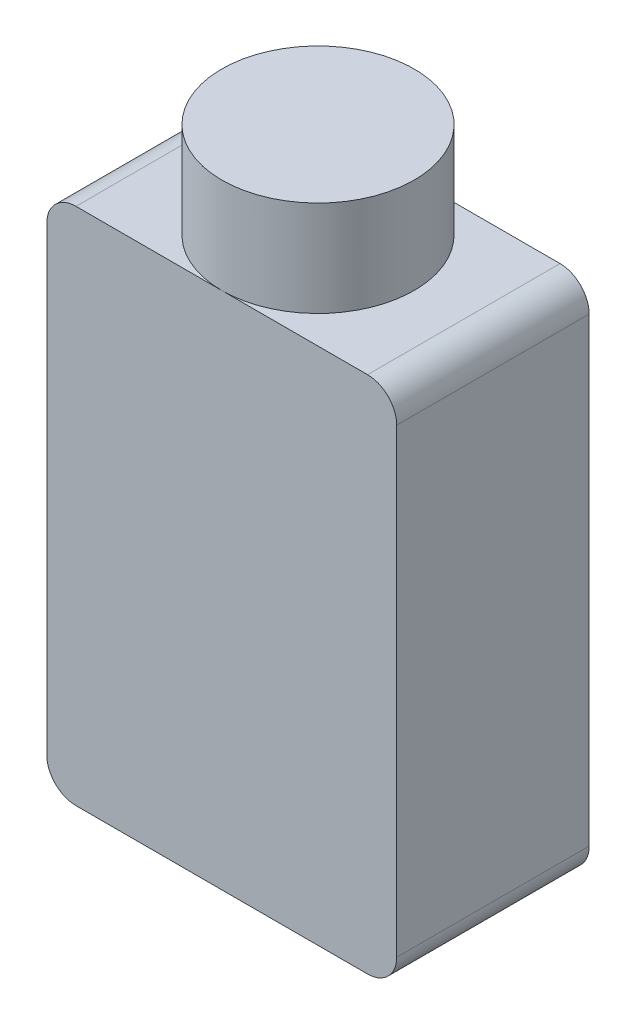
ISO-10303-21;
HEADER;
FILE_DESCRIPTION(('STEP AP214'),'2;1');
FILE_NAME('part.step','',(''),(''),'','','');
FILE_SCHEMA(('AUTOMOTIVE_DESIGN { 1 0 10303 214 1 1 1 1 }'));
ENDSEC;
DATA;
#1=APPLICATION_CONTEXT('core data for automotive mechanical design processes');
#2=APPLICATION_PROTOCOL_DEFINITION('international standard','automotive_design',2000,#1);
#3=PRODUCT_CONTEXT('',#1,'mechanical');
#4=PRODUCT('Part','Part','',(#3));
#5=PRODUCT_RELATED_PRODUCT_CATEGORY('part','',(#4));
#6=PRODUCT_DEFINITION_FORMATION('','',#4);
#7=PRODUCT_DEFINITION_CONTEXT('part definition',#1,'design');
#8=PRODUCT_DEFINITION('design','',#6,#7);
#9=PRODUCT_DEFINITION_SHAPE('','',#8);
#10=(LENGTH_UNIT() NAMED_UNIT(*) SI_UNIT(.MILLI.,.METRE.));
#11=(NAMED_UNIT(*) PLANE_ANGLE_UNIT() SI_UNIT($,.RADIAN.));
#12=(NAMED_UNIT(*) SI_UNIT($,.STERADIAN.) SOLID_ANGLE_UNIT());
#13=UNCERTAINTY_MEASURE_WITH_UNIT(LENGTH_MEASURE(1.E-05),#10,'distance_accuracy_value','');
#14=(GEOMETRIC_REPRESENTATION_CONTEXT(3) GLOBAL_UNCERTAINTY_ASSIGNED_CONTEXT((#13)) GLOBAL_UNIT_ASSIGNED_CONTEXT((#10,
#11,#12)) REPRESENTATION_CONTEXT('',''));
#15=CARTESIAN_POINT('',(0.,0.,0.));
#16=DIRECTION('',(0.,0.,1.));
#17=DIRECTION('',(1.,0.,0.));
#18=AXIS2_PLACEMENT_3D('',#15,#16,#17);
#19=CARTESIAN_POINT('',(0.,56.515,0.));
#20=DIRECTION('',(0.,-1.,0.));
#21=DIRECTION('',(0.,0.,-1.));
#22=AXIS2_PLACEMENT_3D('',#19,#20,#21);
#23=PLANE('',#22);
#24=CARTESIAN_POINT('',(0.,56.515,0.));
#25=DIRECTION('',(0.,-1.,0.));
#26=DIRECTION('',(0.,0.,-1.));
#27=AXIS2_PLACEMENT_3D('',#24,#25,#26);
#28=CIRCLE('',#27,10.4775);
#29=CARTESIAN_POINT('',(0.,56.515,-10.4775));
#30=VERTEX_POINT('',#29);
#31=CARTESIAN_POINT('',(0.,56.515,10.4775));
#32=VERTEX_POINT('',#31);
#33=EDGE_CURVE('E11',#30,#32,#28,.F.);
#34=ORIENTED_EDGE('',*,*,#33,.F.);
#35=DIRECTION('',(-1.,0.,0.));
#36=VECTOR('',#35,1.);
#37=CARTESIAN_POINT('',(-19.05,56.515,-10.4775));
#38=LINE('',#37,#36);
#39=CARTESIAN_POINT('',(-15.875,56.515,-10.4775));
#40=VERTEX_POINT('',#39);
#41=EDGE_CURVE('E123',#30,#40,#38,.T.);
#42=ORIENTED_EDGE('',*,*,#41,.T.);
#43=DIRECTION('',(0.,0.,1.));
#44=VECTOR('',#43,1.);
#45=CARTESIAN_POINT('',(-15.875,56.515,0.));
#46=LINE('',#45,#44);
#47=CARTESIAN_POINT('',(-15.875,56.515,10.4775));
#48=VERTEX_POINT('',#47);
#49=EDGE_CURVE('E175',#40,#48,#46,.T.);
#50=ORIENTED_EDGE('',*,*,#49,.T.);
#51=DIRECTION('',(1.,0.,0.));
#52=VECTOR('',#51,1.);
#53=CARTESIAN_POINT('',(-19.05,56.515,10.4775));
#54=LINE('',#53,#52);
#55=EDGE_CURVE('E138',#48,#32,#54,.T.);
#56=ORIENTED_EDGE('',*,*,#55,.T.);
#57=EDGE_LOOP('',(#34,#42,#50,#56));
#58=FACE_BOUND('',#57,.T.);
#59=ADVANCED_FACE('F43',(#58),#23,.F.);
#60=CARTESIAN_POINT('',(19.05,56.515,10.4775));
#61=DIRECTION('',(-1.,0.,0.));
#62=DIRECTION('',(0.,0.,1.));
#63=AXIS2_PLACEMENT_3D('',#60,#61,#62);
#64=PLANE('',#63);
#65=DIRECTION('',(0.,-1.,0.));
#66=VECTOR('',#65,1.);
#67=CARTESIAN_POINT('',(19.05,56.515,10.4775));
#68=LINE('',#67,#66);
#69=CARTESIAN_POINT('',(19.05,53.34,10.4775));
#70=VERTEX_POINT('',#69);
#71=CARTESIAN_POINT('',(19.05,3.17500000000001,10.4775));
#72=VERTEX_POINT('',#71);
#73=EDGE_CURVE('E151',#70,#72,#68,.T.);
#74=ORIENTED_EDGE('',*,*,#73,.T.);
#75=DIRECTION('',(0.,0.,-1.));
#76=VECTOR('',#75,1.);
#77=CARTESIAN_POINT('',(19.05,3.175,-10.4775));
#78=LINE('',#77,#76);
#79=CARTESIAN_POINT('',(19.05,3.17500000000001,-10.4775));
#80=VERTEX_POINT('',#79);
#81=EDGE_CURVE('E52',#72,#80,#78,.T.);
#82=ORIENTED_EDGE('',*,*,#81,.T.);
#83=DIRECTION('',(0.,-1.,0.));
#84=VECTOR('',#83,1.);
#85=CARTESIAN_POINT('',(19.05,56.515,-10.4775));
#86=LINE('',#85,#84);
#87=CARTESIAN_POINT('',(19.05,53.34,-10.4775));
#88=VERTEX_POINT('',#87);
#89=EDGE_CURVE('E169',#88,#80,#86,.T.);
#90=ORIENTED_EDGE('',*,*,#89,.F.);
#91=DIRECTION('',(0.,0.,-1.));
#92=VECTOR('',#91,1.);
#93=CARTESIAN_POINT('',(19.05,53.34,10.4775));
#94=LINE('',#93,#92);
#95=EDGE_CURVE('E214',#88,#70,#94,.F.);
#96=ORIENTED_EDGE('',*,*,#95,.T.);
#97=EDGE_LOOP('',(#74,#82,#90,#96));
#98=FACE_BOUND('',#97,.T.);
#99=ADVANCED_FACE('F219',(#98),#64,.F.);
#100=CARTESIAN_POINT('',(-19.05,56.515,-10.4775));
#101=DIRECTION('',(0.,0.,1.));
#102=DIRECTION('',(1.,0.,0.));
#103=AXIS2_PLACEMENT_3D('',#100,#101,#102);
#104=PLANE('',#103);
#105=DIRECTION('',(0.,-1.,0.));
#106=VECTOR('',#105,1.);
#107=CARTESIAN_POINT('',(-19.05,56.515,-10.4775));
#108=LINE('',#107,#106);
#109=CARTESIAN_POINT('',(-19.05,53.34,-10.4775));
#110=VERTEX_POINT('',#109);
#111=CARTESIAN_POINT('',(-19.05,3.17500000000001,-10.4775));
#112=VERTEX_POINT('',#111);
#113=EDGE_CURVE('E165',#110,#112,#108,.T.);
#114=ORIENTED_EDGE('',*,*,#113,.F.);
#115=CARTESIAN_POINT('',(-15.875,53.34,-10.4775));
#116=DIRECTION('',(0.,0.,1.));
#117=DIRECTION('',(1.,0.,0.));
#118=AXIS2_PLACEMENT_3D('',#115,#116,#117);
#119=CIRCLE('',#118,3.175);
#120=EDGE_CURVE('E130',#110,#40,#119,.F.);
#121=ORIENTED_EDGE('',*,*,#120,.T.);
#122=ORIENTED_EDGE('',*,*,#41,.F.);
#123=CARTESIAN_POINT('',(15.875,56.515,-10.4775));
#124=VERTEX_POINT('',#123);
#125=EDGE_CURVE('E115',#124,#30,#38,.T.);
#126=ORIENTED_EDGE('',*,*,#125,.F.);
#127=CARTESIAN_POINT('',(15.875,53.34,-10.4775));
#128=DIRECTION('',(0.,0.,1.));
#129=DIRECTION('',(1.,0.,0.));
#130=AXIS2_PLACEMENT_3D('',#127,#128,#129);
#131=CIRCLE('',#130,3.175);
#132=EDGE_CURVE('E198',#124,#88,#131,.F.);
#133=ORIENTED_EDGE('',*,*,#132,.T.);
#134=ORIENTED_EDGE('',*,*,#89,.T.);
#135=CARTESIAN_POINT('',(15.875,3.175,-10.4775));
#136=DIRECTION('',(0.,0.,1.));
#137=DIRECTION('',(1.,0.,0.));
#138=AXIS2_PLACEMENT_3D('',#135,#136,#137);
#139=CIRCLE('',#138,3.175);
#140=CARTESIAN_POINT('',(15.875,0.,-10.4775));
#141=VERTEX_POINT('',#140);
#142=EDGE_CURVE('E67',#80,#141,#139,.F.);
#143=ORIENTED_EDGE('',*,*,#142,.T.);
#144=DIRECTION('',(-1.,0.,0.));
#145=VECTOR('',#144,1.);
#146=CARTESIAN_POINT('',(-19.05,0.,-10.4775));
#147=LINE('',#146,#145);
#148=CARTESIAN_POINT('',(-15.875,0.,-10.4775));
#149=VERTEX_POINT('',#148);
#150=EDGE_CURVE('E146',#141,#149,#147,.T.);
#151=ORIENTED_EDGE('',*,*,#150,.T.);
#152=CARTESIAN_POINT('',(-15.875,3.175,-10.4775));
#153=DIRECTION('',(0.,0.,1.));
#154=DIRECTION('',(1.,0.,0.));
#155=AXIS2_PLACEMENT_3D('',#152,#153,#154);
#156=CIRCLE('',#155,3.175);
#157=EDGE_CURVE('E203',#149,#112,#156,.F.);
#158=ORIENTED_EDGE('',*,*,#157,.T.);
#159=EDGE_LOOP('',(#114,#121,#122,#126,#133,#134,#143,#151,#158));
#160=FACE_BOUND('',#159,.T.);
#161=ADVANCED_FACE('F128',(#160),#104,.F.);
#162=CARTESIAN_POINT('',(-19.05,56.515,10.4775));
#163=DIRECTION('',(1.,0.,0.));
#164=DIRECTION('',(0.,0.,-1.));
#165=AXIS2_PLACEMENT_3D('',#162,#163,#164);
#166=PLANE('',#165);
#167=DIRECTION('',(0.,-1.,0.));
#168=VECTOR('',#167,1.);
#169=CARTESIAN_POINT('',(-19.05,56.515,10.4775));
#170=LINE('',#169,#168);
#171=CARTESIAN_POINT('',(-19.05,53.34,10.4775));
#172=VERTEX_POINT('',#171);
#173=CARTESIAN_POINT('',(-19.05,3.17500000000001,10.4775));
#174=VERTEX_POINT('',#173);
#175=EDGE_CURVE('E161',#172,#174,#170,.T.);
#176=ORIENTED_EDGE('',*,*,#175,.F.);
#177=DIRECTION('',(0.,0.,1.));
#178=VECTOR('',#177,1.);
#179=CARTESIAN_POINT('',(-19.05,53.34,10.4775));
#180=LINE('',#179,#178);
#181=EDGE_CURVE('E195',#172,#110,#180,.F.);
#182=ORIENTED_EDGE('',*,*,#181,.T.);
#183=ORIENTED_EDGE('',*,*,#113,.T.);
#184=DIRECTION('',(0.,0.,1.));
#185=VECTOR('',#184,1.);
#186=CARTESIAN_POINT('',(-19.05,3.175,10.4775));
#187=LINE('',#186,#185);
#188=EDGE_CURVE('E191',#112,#174,#187,.T.);
#189=ORIENTED_EDGE('',*,*,#188,.T.);
#190=EDGE_LOOP('',(#176,#182,#183,#189));
#191=FACE_BOUND('',#190,.T.);
#192=ADVANCED_FACE('F239',(#191),#166,.F.);
#193=CARTESIAN_POINT('',(-19.05,56.515,10.4775));
#194=DIRECTION('',(0.,0.,-1.));
#195=DIRECTION('',(-1.,0.,0.));
#196=AXIS2_PLACEMENT_3D('',#193,#194,#195);
#197=PLANE('',#196);
#198=ORIENTED_EDGE('',*,*,#55,.F.);
#199=CARTESIAN_POINT('',(-15.875,53.34,10.4775));
#200=DIRECTION('',(0.,0.,-1.));
#201=DIRECTION('',(-1.,0.,0.));
#202=AXIS2_PLACEMENT_3D('',#199,#200,#201);
#203=CIRCLE('',#202,3.175);
#204=EDGE_CURVE('E188',#48,#172,#203,.F.);
#205=ORIENTED_EDGE('',*,*,#204,.T.);
#206=ORIENTED_EDGE('',*,*,#175,.T.);
#207=CARTESIAN_POINT('',(-15.875,3.175,10.4775));
#208=DIRECTION('',(0.,0.,-1.));
#209=DIRECTION('',(-1.,0.,0.));
#210=AXIS2_PLACEMENT_3D('',#207,#208,#209);
#211=CIRCLE('',#210,3.175);
#212=CARTESIAN_POINT('',(-15.875,0.,10.4775));
#213=VERTEX_POINT('',#212);
#214=EDGE_CURVE('E185',#174,#213,#211,.F.);
#215=ORIENTED_EDGE('',*,*,#214,.T.);
#216=DIRECTION('',(1.,0.,0.));
#217=VECTOR('',#216,1.);
#218=CARTESIAN_POINT('',(-19.05,0.,10.4775));
#219=LINE('',#218,#217);
#220=CARTESIAN_POINT('',(15.875,0.,10.4775));
#221=VERTEX_POINT('',#220);
#222=EDGE_CURVE('E135',#213,#221,#219,.T.);
#223=ORIENTED_EDGE('',*,*,#222,.T.);
#224=CARTESIAN_POINT('',(15.875,3.175,10.4775));
#225=DIRECTION('',(0.,0.,-1.));
#226=DIRECTION('',(-1.,0.,0.));
#227=AXIS2_PLACEMENT_3D('',#224,#225,#226);
#228=CIRCLE('',#227,3.175);
#229=EDGE_CURVE('E182',#221,#72,#228,.F.);
#230=ORIENTED_EDGE('',*,*,#229,.T.);
#231=ORIENTED_EDGE('',*,*,#73,.F.);
#232=CARTESIAN_POINT('',(15.875,53.34,10.4775));
#233=DIRECTION('',(0.,0.,-1.));
#234=DIRECTION('',(-1.,0.,0.));
#235=AXIS2_PLACEMENT_3D('',#232,#233,#234);
#236=CIRCLE('',#235,3.175);
#237=CARTESIAN_POINT('',(15.875,56.515,10.4775));
#238=VERTEX_POINT('',#237);
#239=EDGE_CURVE('E178',#70,#238,#236,.F.);
#240=ORIENTED_EDGE('',*,*,#239,.T.);
#241=EDGE_CURVE('E122',#32,#238,#54,.T.);
#242=ORIENTED_EDGE('',*,*,#241,.F.);
#243=EDGE_LOOP('',(#198,#205,#206,#215,#223,#230,#231,#240,#242));
#244=FACE_BOUND('',#243,.T.);
#245=ADVANCED_FACE('F227',(#244),#197,.F.);
#246=CARTESIAN_POINT('',(0.,56.515,0.));
#247=DIRECTION('',(0.,1.,0.));
#248=DIRECTION('',(0.,0.,1.));
#249=AXIS2_PLACEMENT_3D('',#246,#247,#248);
#250=CIRCLE('',#249,10.4775);
#251=EDGE_CURVE('E59',#32,#30,#250,.T.);
#252=ORIENTED_EDGE('',*,*,#251,.F.);
#253=ORIENTED_EDGE('',*,*,#241,.T.);
#254=DIRECTION('',(0.,0.,-1.));
#255=VECTOR('',#254,1.);
#256=CARTESIAN_POINT('',(15.875,56.515,0.));
#257=LINE('',#256,#255);
#258=EDGE_CURVE('E119',#238,#124,#257,.T.);
#259=ORIENTED_EDGE('',*,*,#258,.T.);
#260=ORIENTED_EDGE('',*,*,#125,.T.);
#261=EDGE_LOOP('',(#252,#253,#259,#260));
#262=FACE_BOUND('',#261,.T.);
#263=ADVANCED_FACE('F117',(#262),#23,.F.);
#264=CARTESIAN_POINT('',(0.,0.,0.));
#265=DIRECTION('',(0.,-1.,0.));
#266=DIRECTION('',(0.,0.,-1.));
#267=AXIS2_PLACEMENT_3D('',#264,#265,#266);
#268=PLANE('',#267);
#269=ORIENTED_EDGE('',*,*,#222,.F.);
#270=DIRECTION('',(0.,0.,1.));
#271=VECTOR('',#270,1.);
#272=CARTESIAN_POINT('',(-15.875,0.,-10.4775));
#273=LINE('',#272,#271);
#274=EDGE_CURVE('E211',#213,#149,#273,.F.);
#275=ORIENTED_EDGE('',*,*,#274,.T.);
#276=ORIENTED_EDGE('',*,*,#150,.F.);
#277=DIRECTION('',(0.,0.,-1.));
#278=VECTOR('',#277,1.);
#279=CARTESIAN_POINT('',(15.875,0.,10.4775));
#280=LINE('',#279,#278);
#281=EDGE_CURVE('E208',#141,#221,#280,.F.);
#282=ORIENTED_EDGE('',*,*,#281,.T.);
#283=EDGE_LOOP('',(#269,#275,#276,#282));
#284=FACE_BOUND('',#283,.T.);
#285=ADVANCED_FACE('F231',(#284),#268,.T.);
#286=CARTESIAN_POINT('',(-15.875,53.34,0.));
#287=DIRECTION('',(0.,0.,1.));
#288=DIRECTION('',(1.,0.,0.));
#289=AXIS2_PLACEMENT_3D('',#286,#287,#288);
#290=CYLINDRICAL_SURFACE('',#289,3.175);
#291=ORIENTED_EDGE('',*,*,#120,.F.);
#292=ORIENTED_EDGE('',*,*,#181,.F.);
#293=ORIENTED_EDGE('',*,*,#204,.F.);
#294=ORIENTED_EDGE('',*,*,#49,.F.);
#295=EDGE_LOOP('',(#291,#292,#293,#294));
#296=FACE_BOUND('',#295,.T.);
#297=ADVANCED_FACE('F242',(#296),#290,.T.);
#298=CARTESIAN_POINT('',(-15.875,3.175,10.4775));
#299=DIRECTION('',(0.,0.,-1.));
#300=DIRECTION('',(-1.,0.,0.));
#301=AXIS2_PLACEMENT_3D('',#298,#299,#300);
#302=CYLINDRICAL_SURFACE('',#301,3.175);
#303=ORIENTED_EDGE('',*,*,#157,.F.);
#304=ORIENTED_EDGE('',*,*,#274,.F.);
#305=ORIENTED_EDGE('',*,*,#214,.F.);
#306=ORIENTED_EDGE('',*,*,#188,.F.);
#307=EDGE_LOOP('',(#303,#304,#305,#306));
#308=FACE_BOUND('',#307,.T.);
#309=ADVANCED_FACE('F236',(#308),#302,.T.);
#310=CARTESIAN_POINT('',(15.875,3.175,10.4775));
#311=DIRECTION('',(0.,0.,1.));
#312=DIRECTION('',(1.,0.,0.));
#313=AXIS2_PLACEMENT_3D('',#310,#311,#312);
#314=CYLINDRICAL_SURFACE('',#313,3.175);
#315=ORIENTED_EDGE('',*,*,#229,.F.);
#316=ORIENTED_EDGE('',*,*,#281,.F.);
#317=ORIENTED_EDGE('',*,*,#142,.F.);
#318=ORIENTED_EDGE('',*,*,#81,.F.);
#319=EDGE_LOOP('',(#315,#316,#317,#318));
#320=FACE_BOUND('',#319,.T.);
#321=ADVANCED_FACE('F229',(#320),#314,.T.);
#322=CARTESIAN_POINT('',(15.875,53.34,0.));
#323=DIRECTION('',(0.,0.,-1.));
#324=DIRECTION('',(-1.,0.,0.));
#325=AXIS2_PLACEMENT_3D('',#322,#323,#324);
#326=CYLINDRICAL_SURFACE('',#325,3.175);
#327=ORIENTED_EDGE('',*,*,#239,.F.);
#328=ORIENTED_EDGE('',*,*,#95,.F.);
#329=ORIENTED_EDGE('',*,*,#132,.F.);
#330=ORIENTED_EDGE('',*,*,#258,.F.);
#331=EDGE_LOOP('',(#327,#328,#329,#330));
#332=FACE_BOUND('',#331,.T.);
#333=ADVANCED_FACE('F45',(#332),#326,.T.);
#334=CARTESIAN_POINT('',(0.,66.929,0.));
#335=DIRECTION('',(0.,-1.,0.));
#336=DIRECTION('',(0.,0.,-1.));
#337=AXIS2_PLACEMENT_3D('',#334,#335,#336);
#338=CYLINDRICAL_SURFACE('',#337,10.4775);
#339=CARTESIAN_POINT('',(0.,66.929,0.));
#340=DIRECTION('',(0.,1.,0.));
#341=DIRECTION('',(0.,0.,1.));
#342=AXIS2_PLACEMENT_3D('',#339,#340,#341);
#343=CIRCLE('',#342,10.4775);
#344=CARTESIAN_POINT('',(0.,66.929,10.4775));
#345=VERTEX_POINT('',#344);
#346=EDGE_CURVE('E142',#345,#345,#343,.T.);
#347=ORIENTED_EDGE('',*,*,#346,.F.);
#348=EDGE_LOOP('',(#347));
#349=FACE_BOUND('',#348,.T.);
#350=ORIENTED_EDGE('',*,*,#251,.T.);
#351=ORIENTED_EDGE('',*,*,#33,.T.);
#352=EDGE_LOOP('',(#350,#351));
#353=FACE_BOUND('',#352,.T.);
#354=ADVANCED_FACE('F140',(#349,#353),#338,.T.);
#355=CARTESIAN_POINT('',(0.,66.929,0.));
#356=DIRECTION('',(0.,1.,0.));
#357=DIRECTION('',(0.,0.,1.));
#358=AXIS2_PLACEMENT_3D('',#355,#356,#357);
#359=PLANE('',#358);
#360=ORIENTED_EDGE('',*,*,#346,.T.);
#361=EDGE_LOOP('',(#360));
#362=FACE_BOUND('',#361,.T.);
#363=ADVANCED_FACE('F333',(#362),#359,.T.);
#364=CLOSED_SHELL('',(#59,#99,#161,#192,#245,#263,#285,#297,#309,#321,#333,#354,#363));
#365=MANIFOLD_SOLID_BREP('B2',#364);
#366=ADVANCED_BREP_SHAPE_REPRESENTATION('',(#18,#365),#14);
#367=SHAPE_DEFINITION_REPRESENTATION(#9,#366);
ENDSEC;
END-ISO-10303-21;
